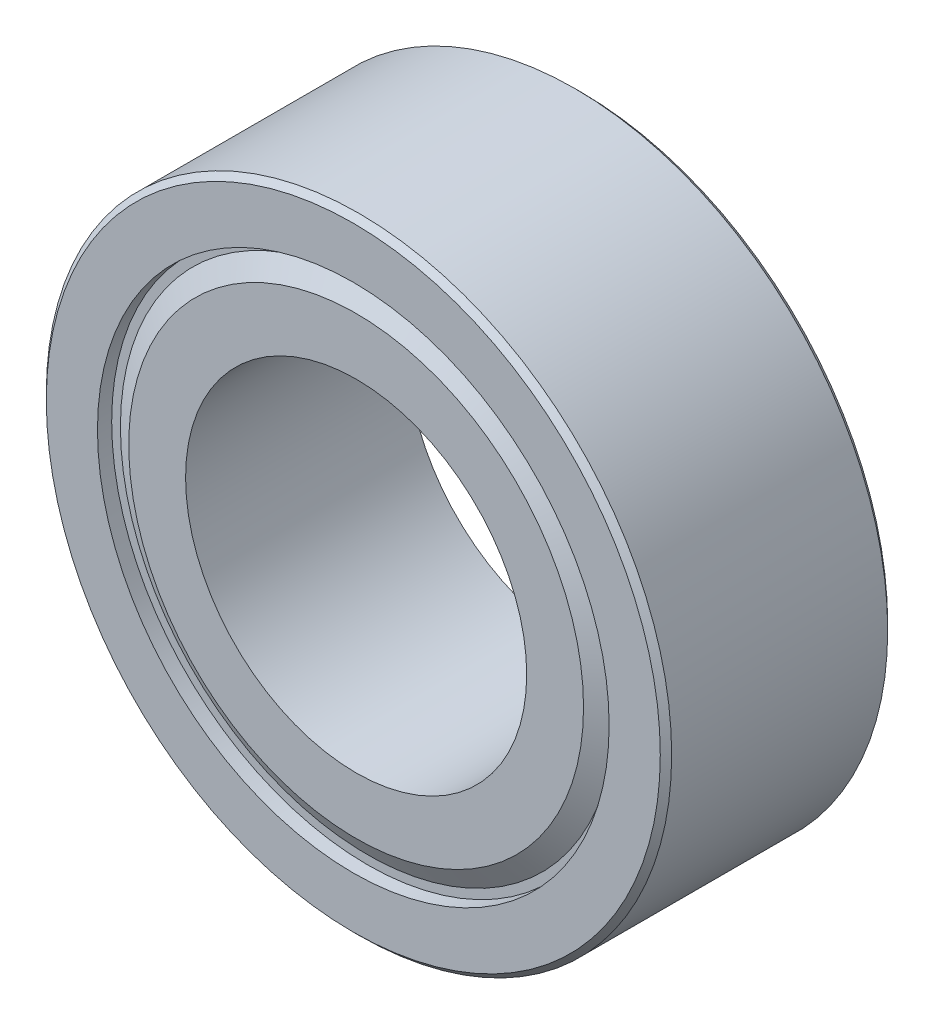
ISO-10303-21;
HEADER;
FILE_DESCRIPTION(('STEP AP214'),'2;1');
FILE_NAME('part.step','',(''),(''),'','','');
FILE_SCHEMA(('AUTOMOTIVE_DESIGN { 1 0 10303 214 1 1 1 1 }'));
ENDSEC;
DATA;
#1=APPLICATION_CONTEXT('core data for automotive mechanical design processes');
#2=APPLICATION_PROTOCOL_DEFINITION('international standard','automotive_design',2000,#1);
#3=PRODUCT_CONTEXT('',#1,'mechanical');
#4=PRODUCT('Part','Part','',(#3));
#5=PRODUCT_RELATED_PRODUCT_CATEGORY('part','',(#4));
#6=PRODUCT_DEFINITION_FORMATION('','',#4);
#7=PRODUCT_DEFINITION_CONTEXT('part definition',#1,'design');
#8=PRODUCT_DEFINITION('design','',#6,#7);
#9=PRODUCT_DEFINITION_SHAPE('','',#8);
#10=(LENGTH_UNIT() NAMED_UNIT(*) SI_UNIT(.MILLI.,.METRE.));
#11=(NAMED_UNIT(*) PLANE_ANGLE_UNIT() SI_UNIT($,.RADIAN.));
#12=(NAMED_UNIT(*) SI_UNIT($,.STERADIAN.) SOLID_ANGLE_UNIT());
#13=UNCERTAINTY_MEASURE_WITH_UNIT(LENGTH_MEASURE(1.E-05),#10,'distance_accuracy_value','');
#14=(GEOMETRIC_REPRESENTATION_CONTEXT(3) GLOBAL_UNCERTAINTY_ASSIGNED_CONTEXT((#13)) GLOBAL_UNIT_ASSIGNED_CONTEXT((#10,
#11,#12)) REPRESENTATION_CONTEXT('',''));
#15=CARTESIAN_POINT('',(0.,0.,0.));
#16=DIRECTION('',(0.,0.,1.));
#17=DIRECTION('',(1.,0.,0.));
#18=AXIS2_PLACEMENT_3D('',#15,#16,#17);
#19=CARTESIAN_POINT('',(0.,-1.65574434004337E-12,-1.12500000000007));
#20=DIRECTION('',(0.,0.,-1.));
#21=DIRECTION('',(0.,1.,0.));
#22=AXIS2_PLACEMENT_3D('',#19,#20,#21);
#23=CYLINDRICAL_SURFACE('',#22,4.50000000000236);
#24=CARTESIAN_POINT('',(0.,-1.65591577153982E-12,-1.00000000000007));
#25=DIRECTION('',(0.,0.,-1.));
#26=DIRECTION('',(1.,0.,0.));
#27=AXIS2_PLACEMENT_3D('',#24,#25,#26);
#28=CIRCLE('',#27,4.50000000000236);
#29=CARTESIAN_POINT('',(4.50000000000236,-1.65591577153982E-12,-1.00000000000007));
#30=VERTEX_POINT('',#29);
#31=EDGE_CURVE('E46',#30,#30,#28,.T.);
#32=ORIENTED_EDGE('',*,*,#31,.F.);
#33=EDGE_LOOP('',(#32));
#34=FACE_BOUND('',#33,.T.);
#35=CARTESIAN_POINT('',(0.,-1.65557290854692E-12,-1.25000000000007));
#36=DIRECTION('',(0.,0.,-1.));
#37=DIRECTION('',(1.,0.,0.));
#38=AXIS2_PLACEMENT_3D('',#35,#36,#37);
#39=CIRCLE('',#38,4.50000000000236);
#40=CARTESIAN_POINT('',(4.50000000000236,-1.65557290854692E-12,-1.25000000000007));
#41=VERTEX_POINT('',#40);
#42=EDGE_CURVE('E10',#41,#41,#39,.T.);
#43=ORIENTED_EDGE('',*,*,#42,.T.);
#44=EDGE_LOOP('',(#43));
#45=FACE_BOUND('',#44,.T.);
#46=ADVANCED_FACE('F15',(#34,#45),#23,.F.);
#47=CARTESIAN_POINT('',(0.,4.5000000000007,-1.25000000000006));
#48=DIRECTION('',(0.,0.,1.));
#49=DIRECTION('',(0.,-1.,0.));
#50=AXIS2_PLACEMENT_3D('',#47,#48,#49);
#51=PLANE('',#50);
#52=CARTESIAN_POINT('',(0.,-1.65557290854692E-12,-1.25000000000006));
#53=DIRECTION('',(0.,0.,-1.));
#54=DIRECTION('',(1.,0.,0.));
#55=AXIS2_PLACEMENT_3D('',#52,#53,#54);
#56=CIRCLE('',#55,4.34641016151375);
#57=CARTESIAN_POINT('',(4.34641016151375,-1.65557290854692E-12,-1.25000000000006));
#58=VERTEX_POINT('',#57);
#59=EDGE_CURVE('E23',#58,#58,#56,.T.);
#60=ORIENTED_EDGE('',*,*,#59,.T.);
#61=EDGE_LOOP('',(#60));
#62=FACE_BOUND('',#61,.T.);
#63=ORIENTED_EDGE('',*,*,#42,.F.);
#64=EDGE_LOOP('',(#63));
#65=FACE_BOUND('',#64,.T.);
#66=ADVANCED_FACE('F17',(#62,#65),#51,.T.);
#67=CARTESIAN_POINT('',(0.,-1.65571005374408E-12,-1.15000000000007));
#68=DIRECTION('',(0.,0.,-1.));
#69=DIRECTION('',(0.,1.,0.));
#70=AXIS2_PLACEMENT_3D('',#67,#68,#69);
#71=CONICAL_SURFACE('',#70,4.17320508075688,1.04719755119659);
#72=CARTESIAN_POINT('',(0.,-1.65584719894124E-12,-1.05000000000008));
#73=DIRECTION('',(0.,0.,-1.));
#74=DIRECTION('',(1.,0.,0.));
#75=AXIS2_PLACEMENT_3D('',#72,#73,#74);
#76=CIRCLE('',#75,4.);
#77=CARTESIAN_POINT('',(4.,-1.65584719894124E-12,-1.05000000000008));
#78=VERTEX_POINT('',#77);
#79=EDGE_CURVE('E32',#78,#78,#76,.T.);
#80=ORIENTED_EDGE('',*,*,#79,.T.);
#81=EDGE_LOOP('',(#80));
#82=FACE_BOUND('',#81,.T.);
#83=ORIENTED_EDGE('',*,*,#59,.F.);
#84=EDGE_LOOP('',(#83));
#85=FACE_BOUND('',#84,.T.);
#86=ADVANCED_FACE('F116',(#82,#85),#71,.T.);
#87=CARTESIAN_POINT('',(0.,3.99999999999835,-1.05000000000007));
#88=DIRECTION('',(0.,0.,1.));
#89=DIRECTION('',(0.,-1.,0.));
#90=AXIS2_PLACEMENT_3D('',#87,#88,#89);
#91=PLANE('',#90);
#92=CARTESIAN_POINT('',(0.,-1.65584719894124E-12,-1.05000000000007));
#93=DIRECTION('',(0.,0.,-1.));
#94=DIRECTION('',(1.,0.,0.));
#95=AXIS2_PLACEMENT_3D('',#92,#93,#94);
#96=CIRCLE('',#95,3.);
#97=CARTESIAN_POINT('',(3.,-1.65584719894124E-12,-1.05000000000007));
#98=VERTEX_POINT('',#97);
#99=EDGE_CURVE('E39',#98,#98,#96,.T.);
#100=ORIENTED_EDGE('',*,*,#99,.T.);
#101=EDGE_LOOP('',(#100));
#102=FACE_BOUND('',#101,.T.);
#103=ORIENTED_EDGE('',*,*,#79,.F.);
#104=EDGE_LOOP('',(#103));
#105=FACE_BOUND('',#104,.T.);
#106=ADVANCED_FACE('F147',(#102,#105),#91,.T.);
#107=CARTESIAN_POINT('',(0.,-1.65451003326894E-12,-2.02500000000007));
#108=DIRECTION('',(0.,0.,-1.));
#109=DIRECTION('',(0.,1.,0.));
#110=AXIS2_PLACEMENT_3D('',#107,#108,#109);
#111=CYLINDRICAL_SURFACE('',#110,3.);
#112=ORIENTED_EDGE('',*,*,#99,.F.);
#113=EDGE_LOOP('',(#112));
#114=FACE_BOUND('',#113,.T.);
#115=CARTESIAN_POINT('',(0.,-1.65049853625202E-12,-4.95000000000006));
#116=DIRECTION('',(0.,0.,-1.));
#117=DIRECTION('',(1.,0.,0.));
#118=AXIS2_PLACEMENT_3D('',#115,#116,#117);
#119=CIRCLE('',#118,3.);
#120=CARTESIAN_POINT('',(3.,-1.65049853625202E-12,-4.95000000000006));
#121=VERTEX_POINT('',#120);
#122=EDGE_CURVE('E59',#121,#121,#119,.T.);
#123=ORIENTED_EDGE('',*,*,#122,.T.);
#124=EDGE_LOOP('',(#123));
#125=FACE_BOUND('',#124,.T.);
#126=ADVANCED_FACE('F137',(#114,#125),#111,.F.);
#127=CARTESIAN_POINT('',(0.,-1.65447574696965E-12,-2.05000000000006));
#128=DIRECTION('',(0.,0.,-1.));
#129=DIRECTION('',(0.,1.,0.));
#130=AXIS2_PLACEMENT_3D('',#127,#128,#129);
#131=CYLINDRICAL_SURFACE('',#130,5.50000000000236);
#132=CARTESIAN_POINT('',(0.,-1.65577862634266E-12,-1.10000000000006));
#133=DIRECTION('',(0.,0.,-1.));
#134=DIRECTION('',(1.,0.,0.));
#135=AXIS2_PLACEMENT_3D('',#132,#133,#134);
#136=CIRCLE('',#135,5.50000000000236);
#137=CARTESIAN_POINT('',(5.50000000000236,-1.65577862634266E-12,-1.10000000000006));
#138=VERTEX_POINT('',#137);
#139=EDGE_CURVE('E45',#138,#138,#136,.T.);
#140=ORIENTED_EDGE('',*,*,#139,.T.);
#141=EDGE_LOOP('',(#140));
#142=FACE_BOUND('',#141,.T.);
#143=CARTESIAN_POINT('',(0.,-1.6505671088506E-12,-4.90000000000007));
#144=DIRECTION('',(0.,0.,-1.));
#145=DIRECTION('',(1.,0.,0.));
#146=AXIS2_PLACEMENT_3D('',#143,#144,#145);
#147=CIRCLE('',#146,5.50000000000236);
#148=CARTESIAN_POINT('',(5.50000000000236,-1.6505671088506E-12,-4.90000000000007));
#149=VERTEX_POINT('',#148);
#150=EDGE_CURVE('E64',#149,#149,#147,.T.);
#151=ORIENTED_EDGE('',*,*,#150,.F.);
#152=EDGE_LOOP('',(#151));
#153=FACE_BOUND('',#152,.T.);
#154=ADVANCED_FACE('F135',(#142,#153),#131,.T.);
#155=CARTESIAN_POINT('',(0.,-1.65584719894124E-12,-1.05000000000006));
#156=DIRECTION('',(0.,0.,-1.));
#157=DIRECTION('',(0.,1.,0.));
#158=AXIS2_PLACEMENT_3D('',#155,#156,#157);
#159=CONICAL_SURFACE('',#158,5.45000000000236,0.785398163397442);
#160=CARTESIAN_POINT('',(0.,-1.65591577153982E-12,-1.00000000000007));
#161=DIRECTION('',(0.,0.,-1.));
#162=DIRECTION('',(1.,0.,0.));
#163=AXIS2_PLACEMENT_3D('',#160,#161,#162);
#164=CIRCLE('',#163,5.40000000000236);
#165=CARTESIAN_POINT('',(5.40000000000236,-1.65591577153982E-12,-1.00000000000007));
#166=VERTEX_POINT('',#165);
#167=EDGE_CURVE('E50',#166,#166,#164,.T.);
#168=ORIENTED_EDGE('',*,*,#167,.T.);
#169=EDGE_LOOP('',(#168));
#170=FACE_BOUND('',#169,.T.);
#171=ORIENTED_EDGE('',*,*,#139,.F.);
#172=EDGE_LOOP('',(#171));
#173=FACE_BOUND('',#172,.T.);
#174=ADVANCED_FACE('F104',(#170,#173),#159,.T.);
#175=CARTESIAN_POINT('',(0.,5.40000000000071,-1.00000000000006));
#176=DIRECTION('',(0.,0.,1.));
#177=DIRECTION('',(0.,-1.,0.));
#178=AXIS2_PLACEMENT_3D('',#175,#176,#177);
#179=PLANE('',#178);
#180=ORIENTED_EDGE('',*,*,#31,.T.);
#181=EDGE_LOOP('',(#180));
#182=FACE_BOUND('',#181,.T.);
#183=ORIENTED_EDGE('',*,*,#167,.F.);
#184=EDGE_LOOP('',(#183));
#185=FACE_BOUND('',#184,.T.);
#186=ADVANCED_FACE('F92',(#182,#185),#179,.T.);
#187=CARTESIAN_POINT('',(0.,-1.65060139514989E-12,-4.87500000000007));
#188=DIRECTION('',(0.,0.,-1.));
#189=DIRECTION('',(0.,1.,0.));
#190=AXIS2_PLACEMENT_3D('',#187,#188,#189);
#191=CYLINDRICAL_SURFACE('',#190,4.50000000000236);
#192=CARTESIAN_POINT('',(0.,-1.65042996365344E-12,-5.00000000000007));
#193=DIRECTION('',(0.,0.,-1.));
#194=DIRECTION('',(1.,0.,0.));
#195=AXIS2_PLACEMENT_3D('',#192,#193,#194);
#196=CIRCLE('',#195,4.50000000000236);
#197=CARTESIAN_POINT('',(4.50000000000236,-1.65042996365344E-12,-5.00000000000007));
#198=VERTEX_POINT('',#197);
#199=EDGE_CURVE('E74',#198,#198,#196,.T.);
#200=ORIENTED_EDGE('',*,*,#199,.T.);
#201=EDGE_LOOP('',(#200));
#202=FACE_BOUND('',#201,.T.);
#203=CARTESIAN_POINT('',(0.,-1.65077282664634E-12,-4.75000000000007));
#204=DIRECTION('',(0.,0.,-1.));
#205=DIRECTION('',(1.,0.,0.));
#206=AXIS2_PLACEMENT_3D('',#203,#204,#205);
#207=CIRCLE('',#206,4.50000000000236);
#208=CARTESIAN_POINT('',(4.50000000000236,-1.65077282664634E-12,-4.75000000000007));
#209=VERTEX_POINT('',#208);
#210=EDGE_CURVE('E54',#209,#209,#207,.T.);
#211=ORIENTED_EDGE('',*,*,#210,.F.);
#212=EDGE_LOOP('',(#211));
#213=FACE_BOUND('',#212,.T.);
#214=ADVANCED_FACE('F90',(#202,#213),#191,.F.);
#215=CARTESIAN_POINT('',(0.,4.50000000000071,-4.75000000000006));
#216=DIRECTION('',(0.,0.,1.));
#217=DIRECTION('',(0.,-1.,0.));
#218=AXIS2_PLACEMENT_3D('',#215,#216,#217);
#219=PLANE('',#218);
#220=CARTESIAN_POINT('',(0.,-1.65077282664634E-12,-4.75000000000007));
#221=DIRECTION('',(0.,0.,-1.));
#222=DIRECTION('',(1.,0.,0.));
#223=AXIS2_PLACEMENT_3D('',#220,#221,#222);
#224=CIRCLE('',#223,4.34641016151375);
#225=CARTESIAN_POINT('',(4.34641016151375,-1.65077282664634E-12,-4.75000000000007));
#226=VERTEX_POINT('',#225);
#227=EDGE_CURVE('E55',#226,#226,#224,.T.);
#228=ORIENTED_EDGE('',*,*,#227,.F.);
#229=EDGE_LOOP('',(#228));
#230=FACE_BOUND('',#229,.T.);
#231=ORIENTED_EDGE('',*,*,#210,.T.);
#232=EDGE_LOOP('',(#231));
#233=FACE_BOUND('',#232,.T.);
#234=ADVANCED_FACE('F88',(#230,#233),#219,.F.);
#235=CARTESIAN_POINT('',(0.,-1.65063568144918E-12,-4.85000000000006));
#236=DIRECTION('',(0.,0.,1.));
#237=DIRECTION('',(0.,1.,0.));
#238=AXIS2_PLACEMENT_3D('',#235,#236,#237);
#239=CONICAL_SURFACE('',#238,4.17320508075688,1.04719755119659);
#240=CARTESIAN_POINT('',(0.,-1.65049853625202E-12,-4.95000000000006));
#241=DIRECTION('',(0.,0.,-1.));
#242=DIRECTION('',(1.,0.,0.));
#243=AXIS2_PLACEMENT_3D('',#240,#241,#242);
#244=CIRCLE('',#243,4.);
#245=CARTESIAN_POINT('',(4.,-1.65049853625202E-12,-4.95000000000006));
#246=VERTEX_POINT('',#245);
#247=EDGE_CURVE('E60',#246,#246,#244,.T.);
#248=ORIENTED_EDGE('',*,*,#247,.F.);
#249=EDGE_LOOP('',(#248));
#250=FACE_BOUND('',#249,.T.);
#251=ORIENTED_EDGE('',*,*,#227,.T.);
#252=EDGE_LOOP('',(#251));
#253=FACE_BOUND('',#252,.T.);
#254=ADVANCED_FACE('F101',(#250,#253),#239,.T.);
#255=CARTESIAN_POINT('',(0.,3.99999999999836,-4.95));
#256=DIRECTION('',(0.,0.,1.));
#257=DIRECTION('',(0.,-1.,0.));
#258=AXIS2_PLACEMENT_3D('',#255,#256,#257);
#259=PLANE('',#258);
#260=ORIENTED_EDGE('',*,*,#122,.F.);
#261=EDGE_LOOP('',(#260));
#262=FACE_BOUND('',#261,.T.);
#263=ORIENTED_EDGE('',*,*,#247,.T.);
#264=EDGE_LOOP('',(#263));
#265=FACE_BOUND('',#264,.T.);
#266=ADVANCED_FACE('F124',(#262,#265),#259,.F.);
#267=CARTESIAN_POINT('',(0.,-1.65049853625202E-12,-4.95000000000007));
#268=DIRECTION('',(0.,0.,1.));
#269=DIRECTION('',(0.,1.,0.));
#270=AXIS2_PLACEMENT_3D('',#267,#268,#269);
#271=CONICAL_SURFACE('',#270,5.45000000000236,0.785398163397442);
#272=CARTESIAN_POINT('',(0.,-1.65042996365344E-12,-5.00000000000006));
#273=DIRECTION('',(0.,0.,-1.));
#274=DIRECTION('',(1.,0.,0.));
#275=AXIS2_PLACEMENT_3D('',#272,#273,#274);
#276=CIRCLE('',#275,5.40000000000236);
#277=CARTESIAN_POINT('',(5.40000000000236,-1.65042996365344E-12,-5.00000000000006));
#278=VERTEX_POINT('',#277);
#279=EDGE_CURVE('E78',#278,#278,#276,.T.);
#280=ORIENTED_EDGE('',*,*,#279,.F.);
#281=EDGE_LOOP('',(#280));
#282=FACE_BOUND('',#281,.T.);
#283=ORIENTED_EDGE('',*,*,#150,.T.);
#284=EDGE_LOOP('',(#283));
#285=FACE_BOUND('',#284,.T.);
#286=ADVANCED_FACE('F121',(#282,#285),#271,.T.);
#287=CARTESIAN_POINT('',(0.,5.40000000000072,-5.00000000000006));
#288=DIRECTION('',(0.,0.,1.));
#289=DIRECTION('',(0.,-1.,0.));
#290=AXIS2_PLACEMENT_3D('',#287,#288,#289);
#291=PLANE('',#290);
#292=ORIENTED_EDGE('',*,*,#199,.F.);
#293=EDGE_LOOP('',(#292));
#294=FACE_BOUND('',#293,.T.);
#295=ORIENTED_EDGE('',*,*,#279,.T.);
#296=EDGE_LOOP('',(#295));
#297=FACE_BOUND('',#296,.T.);
#298=ADVANCED_FACE('F119',(#294,#297),#291,.F.);
#299=CLOSED_SHELL('',(#46,#66,#86,#106,#126,#154,#174,#186,#214,#234,#254,#266,#286,#298));
#300=MANIFOLD_SOLID_BREP('B1',#299);
#301=ADVANCED_BREP_SHAPE_REPRESENTATION('',(#18,#300),#14);
#302=SHAPE_DEFINITION_REPRESENTATION(#9,#301);
ENDSEC;
END-ISO-10303-21;
